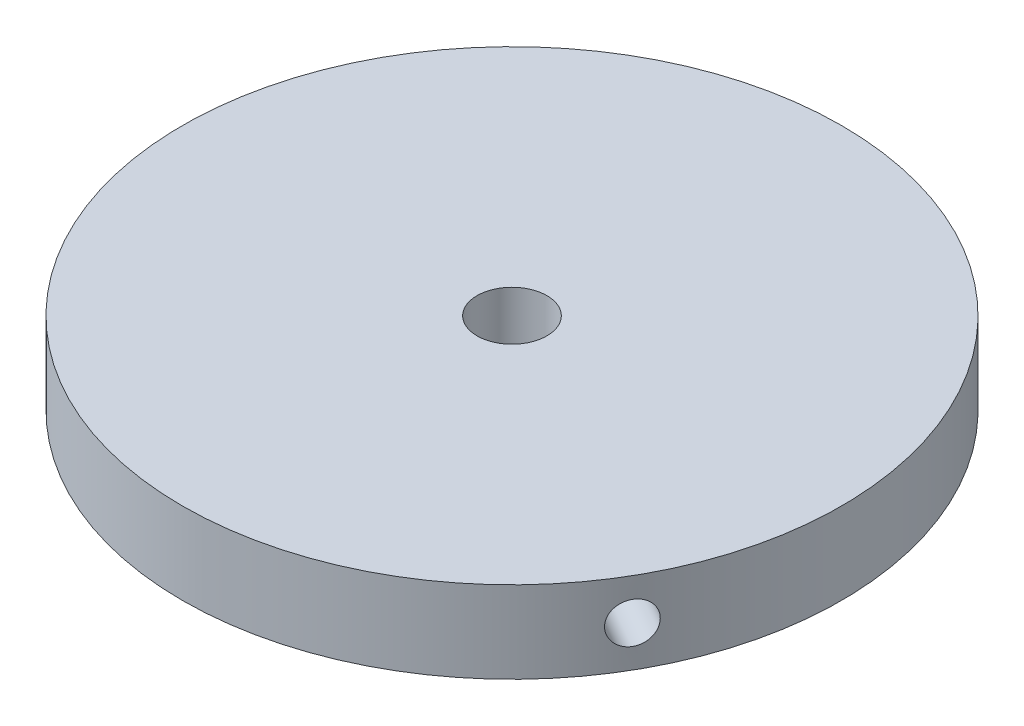
ISO-10303-21;
HEADER;
FILE_DESCRIPTION(('STEP AP214'),'2;1');
FILE_NAME('part.step','',(''),(''),'','','');
FILE_SCHEMA(('AUTOMOTIVE_DESIGN { 1 0 10303 214 1 1 1 1 }'));
ENDSEC;
DATA;
#1=APPLICATION_CONTEXT('core data for automotive mechanical design processes');
#2=APPLICATION_PROTOCOL_DEFINITION('international standard','automotive_design',2000,#1);
#3=PRODUCT_CONTEXT('',#1,'mechanical');
#4=PRODUCT('Part','Part','',(#3));
#5=PRODUCT_RELATED_PRODUCT_CATEGORY('part','',(#4));
#6=PRODUCT_DEFINITION_FORMATION('','',#4);
#7=PRODUCT_DEFINITION_CONTEXT('part definition',#1,'design');
#8=PRODUCT_DEFINITION('design','',#6,#7);
#9=PRODUCT_DEFINITION_SHAPE('','',#8);
#10=(LENGTH_UNIT() NAMED_UNIT(*) SI_UNIT(.MILLI.,.METRE.));
#11=(NAMED_UNIT(*) PLANE_ANGLE_UNIT() SI_UNIT($,.RADIAN.));
#12=(NAMED_UNIT(*) SI_UNIT($,.STERADIAN.) SOLID_ANGLE_UNIT());
#13=UNCERTAINTY_MEASURE_WITH_UNIT(LENGTH_MEASURE(1.E-05),#10,'distance_accuracy_value','');
#14=(GEOMETRIC_REPRESENTATION_CONTEXT(3) GLOBAL_UNCERTAINTY_ASSIGNED_CONTEXT((#13)) GLOBAL_UNIT_ASSIGNED_CONTEXT((#10,
#11,#12)) REPRESENTATION_CONTEXT('',''));
#15=CARTESIAN_POINT('',(0.,0.,0.));
#16=DIRECTION('',(0.,0.,1.));
#17=DIRECTION('',(1.,0.,0.));
#18=AXIS2_PLACEMENT_3D('',#15,#16,#17);
#19=CARTESIAN_POINT('',(0.,9.525,0.));
#20=DIRECTION('',(0.,-1.,0.));
#21=DIRECTION('',(0.,0.,-1.));
#22=AXIS2_PLACEMENT_3D('',#19,#20,#21);
#23=CYLINDRICAL_SURFACE('',#22,38.354);
#24=CARTESIAN_POINT('',(-2.37489999999947,4.7625,-38.2804018525146));
#25=CARTESIAN_POINT('',(-2.37489413527644,4.62923809089192,-38.280402837307));
#26=CARTESIAN_POINT('',(-2.36364579205728,4.49588281019358,-38.2811052035353));
#27=CARTESIAN_POINT('',(-2.31893528967372,4.23285434302784,-38.2838391152481));
#28=CARTESIAN_POINT('',(-2.28544725825848,4.10318562870893,-38.2858722087771));
#29=CARTESIAN_POINT('',(-2.19722280005429,3.85137838047477,-38.2910364070698));
#30=CARTESIAN_POINT('',(-2.14249756959359,3.72923591794559,-38.2941669331792));
#31=CARTESIAN_POINT('',(-2.0133702265039,3.49590258604333,-38.3011725260395));
#32=CARTESIAN_POINT('',(-1.93897262662695,3.38470921301708,-38.3050474219797));
#33=CARTESIAN_POINT('',(-1.77249177631182,3.17623409838296,-38.313111626275));
#34=CARTESIAN_POINT('',(-1.68038560702465,3.07897067303235,-38.3173013377438));
#35=CARTESIAN_POINT('',(-1.4811493827142,2.90127312255656,-38.3255193340163));
#36=CARTESIAN_POINT('',(-1.37401870204228,2.82083969861176,-38.3295476120886));
#37=CARTESIAN_POINT('',(-1.14767193856091,2.67902969934687,-38.3369922882502));
#38=CARTESIAN_POINT('',(-1.02844640814934,2.617668176002,-38.3404082021527));
#39=CARTESIAN_POINT('',(-0.781360599532736,2.51584020554425,-38.3462390227638));
#40=CARTESIAN_POINT('',(-0.653500412377955,2.47537353813936,-38.3486539400257));
#41=CARTESIAN_POINT('',(-0.392950312927091,2.41653451916251,-38.3522078864979));
#42=CARTESIAN_POINT('',(-0.260266868395017,2.39813362823547,-38.3533485636492));
#43=CARTESIAN_POINT('',(0.00631003831154012,2.38386036623799,-38.3542310483331));
#44=CARTESIAN_POINT('',(0.140203487041637,2.38798774516191,-38.3539728713895));
#45=CARTESIAN_POINT('',(0.405206350489969,2.4186303095414,-38.3520881155161));
#46=CARTESIAN_POINT('',(0.536319330484603,2.44511479320974,-38.3504634131721));
#47=CARTESIAN_POINT('',(0.79223504475657,2.51967212930872,-38.3460306871079));
#48=CARTESIAN_POINT('',(0.917037742277915,2.56774510747139,-38.3432226564961));
#49=CARTESIAN_POINT('',(1.15688876407876,2.6841495937017,-38.3367362172293));
#50=CARTESIAN_POINT('',(1.27193031723789,2.75249501899231,-38.3330572109929));
#51=CARTESIAN_POINT('',(1.4889194906947,2.90749419472858,-38.32524287678));
#52=CARTESIAN_POINT('',(1.59086696643578,2.99414814726964,-38.3211075437668));
#53=CARTESIAN_POINT('',(1.77895325879323,3.18347799568063,-38.3128377790858));
#54=CARTESIAN_POINT('',(1.86506525449627,3.28618053913264,-38.3087033605807));
#55=CARTESIAN_POINT('',(2.01882939779048,3.50459884614974,-38.3009084798889));
#56=CARTESIAN_POINT('',(2.0864815381791,3.62031461479223,-38.2972480178872));
#57=CARTESIAN_POINT('',(2.20140364078542,3.8614916273744,-38.2908143984836));
#58=CARTESIAN_POINT('',(2.24867247949577,3.98695340805489,-38.2880412899939));
#59=CARTESIAN_POINT('',(2.32146770175679,4.24405325203897,-38.2836968563364));
#60=CARTESIAN_POINT('',(2.34699433633765,4.37569124401501,-38.2821255172932));
#61=CARTESIAN_POINT('',(2.37554713938468,4.64117285013254,-38.2803644239049));
#62=CARTESIAN_POINT('',(2.3786105873768,4.77501244030646,-38.2801723805149));
#63=CARTESIAN_POINT('',(2.36224745372705,5.04130366654735,-38.2811855558711));
#64=CARTESIAN_POINT('',(2.34282098691788,5.17375530969764,-38.2823907674829));
#65=CARTESIAN_POINT('',(2.28206043506427,5.43340543759909,-38.2860605414526));
#66=CARTESIAN_POINT('',(2.24074351377086,5.56060795394907,-38.2885241171049));
#67=CARTESIAN_POINT('',(2.13739227430593,5.80627343777458,-38.2944321528365));
#68=CARTESIAN_POINT('',(2.07535777171955,5.92473632744399,-38.297876621647));
#69=CARTESIAN_POINT('',(1.9322370171523,6.14973108341426,-38.3053638317819));
#70=CARTESIAN_POINT('',(1.85112578277799,6.25624703183816,-38.3094073550205));
#71=CARTESIAN_POINT('',(1.67219038274815,6.45416396797893,-38.3176342635312));
#72=CARTESIAN_POINT('',(1.57436605635773,6.54556481031257,-38.3218176501481));
#73=CARTESIAN_POINT('',(1.36462091887408,6.71078288610321,-38.3298595625683));
#74=CARTESIAN_POINT('',(1.25268108722025,6.7845759977581,-38.3337176380872));
#75=CARTESIAN_POINT('',(1.01797818211975,6.91231883823295,-38.3406677229239));
#76=CARTESIAN_POINT('',(0.895215174435373,6.96626868761152,-38.343759736896));
#77=CARTESIAN_POINT('',(0.642439443840704,7.05275159763808,-38.3488271428147));
#78=CARTESIAN_POINT('',(0.512431963669555,7.08529993345883,-38.350803331031));
#79=CARTESIAN_POINT('',(0.248784802508945,7.12810588034381,-38.3534195842414));
#80=CARTESIAN_POINT('',(0.115145156485495,7.13836370591669,-38.3540596620933));
#81=CARTESIAN_POINT('',(-0.151733997415274,7.13629537087301,-38.3539316119804));
#82=CARTESIAN_POINT('',(-0.284973800673779,7.12400696553796,-38.3531658382137));
#83=CARTESIAN_POINT('',(-0.547494398021122,7.07727325897385,-38.3503168773641));
#84=CARTESIAN_POINT('',(-0.676775185120192,7.04282791862838,-38.3482336879553));
#85=CARTESIAN_POINT('',(-0.927713747359632,6.9527665950289,-38.3429840573992));
#86=CARTESIAN_POINT('',(-1.04937156996449,6.89715074360862,-38.3398176229976));
#87=CARTESIAN_POINT('',(-1.28162755978365,6.76633244436232,-38.3327570505148));
#88=CARTESIAN_POINT('',(-1.39222601645427,6.69113050934784,-38.3288629314869));
#89=CARTESIAN_POINT('',(-1.59941512264165,6.52313545836678,-38.3207772984907));
#90=CARTESIAN_POINT('',(-1.69598366496083,6.43031510026139,-38.316585330344));
#91=CARTESIAN_POINT('',(-1.87220132348107,6.22975362752857,-38.3083800523644));
#92=CARTESIAN_POINT('',(-1.95184629201931,6.1220088658622,-38.3043667865182));
#93=CARTESIAN_POINT('',(-2.09201385416864,5.89453587654806,-38.2969677917123));
#94=CARTESIAN_POINT('',(-2.15251287202954,5.77479311183602,-38.2935828385411));
#95=CARTESIAN_POINT('',(-2.25247359450025,5.52691573865806,-38.2878336952392));
#96=CARTESIAN_POINT('',(-2.29195994955222,5.39879116220686,-38.285468309652));
#97=CARTESIAN_POINT('',(-2.33850674891413,5.18531841211593,-38.2826463054199));
#98=CARTESIAN_POINT('',(-2.35213658153623,5.10135027860589,-38.2818083941843));
#99=CARTESIAN_POINT('',(-2.37033507097683,4.9324340875067,-38.2806858540897));
#100=CARTESIAN_POINT('',(-2.3749037401495,4.84748603125375,-38.2804012244762));
#101=CARTESIAN_POINT('',(-2.37489999999947,4.7625,-38.2804018525146));
#102=B_SPLINE_CURVE_WITH_KNOTS('',3,(#24,#25,#26,#27,#28,#29,#30,#31,#32,#33,#34,#35,#36,#37,
#38,#39,#40,#41,#42,#43,#44,#45,#46,#47,#48,#49,#50,#51,#52,#53,#54,#55,#56,#57,#58,#59,#60,#61,
#62,#63,#64,#65,#66,#67,#68,#69,#70,#71,#72,#73,#74,#75,#76,#77,#78,#79,#80,#81,#82,#83,#84,#85,
#86,#87,#88,#89,#90,#91,#92,#93,#94,#95,#96,#97,#98,#99,#100,#101),.UNSPECIFIED.,.T.,.F.,(4,2,2,
2,2,2,2,2,2,2,2,2,2,2,2,2,2,2,2,2,2,2,2,2,2,2,2,2,2,2,2,2,2,2,2,2,2,2,4),(0.,0.399475476302926,
0.799416493165484,1.1991469454962,1.59878578090996,1.99894536307211,2.39912161357536,
2.7996128949367,3.20009995387938,3.60006847169276,4.00003255089726,4.39944827316248,
4.79886632166716,5.19855921151562,5.59825651353268,5.99862467916022,6.3989930010006,
6.79938338792527,7.19976915197735,7.59949029185472,7.99920939077927,8.39861554288699,
8.79802525035158,9.19796095582233,9.59790050781335,9.99838485314968,10.3988667652857,
10.7990625252291,11.1992544339451,11.5987768041428,11.9982998796691,12.3978204673125,
12.7973305955817,13.1974635662305,13.5976944894359,13.9984163444992,14.3986670613082,
14.6534276439034,14.908187879153),.UNSPECIFIED.);
#103=CARTESIAN_POINT('',(-2.37489999999947,4.7625,-38.2804018525146));
#104=VERTEX_POINT('',#103);
#105=EDGE_CURVE('E63',#104,#104,#102,.T.);
#106=ORIENTED_EDGE('',*,*,#105,.T.);
#107=EDGE_LOOP('',(#106));
#108=FACE_BOUND('',#107,.T.);
#109=CARTESIAN_POINT('',(34.3392504713542,4.7625,17.0834771948103));
#110=CARTESIAN_POINT('',(34.3392483918479,4.62923809089192,17.0834827662056));
#111=CARTESIAN_POINT('',(34.3342324872348,4.49588281019358,17.093575300298));
#112=CARTESIAN_POINT('',(34.314244873038,4.23285434302784,17.1336626870345));
#113=CARTESIAN_POINT('',(34.2992615679748,4.10318562870893,17.1636807197274));
#114=CARTESIAN_POINT('',(34.2596216657844,3.85137838047477,17.2426674409137));
#115=CARTESIAN_POINT('',(34.2349701656919,3.72923591794559,17.2916261437753));
#116=CARTESIAN_POINT('',(34.1764735155327,3.49590258604333,17.4069564996443));
#117=CARTESIAN_POINT('',(34.1426304739154,3.38470921301708,17.4733241590884));
#118=CARTESIAN_POINT('',(34.0663738545389,3.17623409838296,17.6215329068526));
#119=CARTESIAN_POINT('',(34.0239491664619,3.07897067303234,17.703394045035));
#120=CARTESIAN_POINT('',(33.9314480478468,2.90127312255655,17.8800466747782));
#121=CARTESIAN_POINT('',(33.8813712986549,2.82083969861176,17.9748387048009));
#122=CARTESIAN_POINT('',(33.7746451955932,2.67902969934687,18.174583090121));
#123=CARTESIAN_POINT('',(33.7179906986041,2.617668176002,18.2795433851883));
#124=CARTESIAN_POINT('',(33.5994974330699,2.51584020554425,18.4964413826705));
#125=CARTESIAN_POINT('',(33.5376587191893,2.47537353813936,18.6083790115101));
#126=CARTESIAN_POINT('',(33.4104614773925,2.41653451916251,18.8357989898292));
#127=CARTESIAN_POINT('',(33.345107610517,2.39813362823547,18.9512765620312));
#128=CARTESIAN_POINT('',(33.2125834113185,2.38386036623799,19.1825801776434));
#129=CARTESIAN_POINT('',(33.1454130991616,2.38798774516191,19.2984062171721));
#130=CARTESIAN_POINT('',(33.0112794209712,2.4186303095414,19.5269630510573));
#131=CARTESIAN_POINT('',(32.9443158974703,2.44511479320974,19.6396978713265));
#132=CARTESIAN_POINT('',(32.8125191869547,2.51967212930872,19.8591110180816));
#133=CARTESIAN_POINT('',(32.7476860123496,2.56774510747139,19.96578930929));
#134=CARTESIAN_POINT('',(32.6221430802641,2.6841495937017,20.1702631676598));
#135=CARTESIAN_POINT('',(32.5614361908231,2.75249501899231,20.2680525720682));
#136=CARTESIAN_POINT('',(32.4461741921527,2.90749419472859,20.4520635415216));
#137=CARTESIAN_POINT('',(32.3916191508395,2.99414814726964,20.5382849788584));
#138=CARTESIAN_POINT('',(32.2904141783638,3.18347799568063,20.6970376038031));
#139=CARTESIAN_POINT('',(32.243777669057,3.28618053913264,20.7695455704));
#140=CARTESIAN_POINT('',(32.1601450327113,3.50459884614974,20.898811784338));
#141=CARTESIAN_POINT('',(32.1231489094339,3.62031461479223,20.9555700255341));
#142=CARTESIAN_POINT('',(32.0601161802889,3.8614916273744,21.0518786761456));
#143=CARTESIAN_POINT('',(32.0340801785343,3.98695340805489,21.0914281370314));
#144=CARTESIAN_POINT('',(31.9939201774913,4.24405325203897,21.1522984319548));
#145=CARTESIAN_POINT('',(31.9797960406715,4.37569124401501,21.1736194764533));
#146=CARTESIAN_POINT('',(31.9639944875353,4.64117285013254,21.1974663825472));
#147=CARTESIAN_POINT('',(31.9622964490848,4.77501244030646,21.2000233846365));
#148=CARTESIAN_POINT('',(31.9713554515066,5.04130366654735,21.1863590828884));
#149=CARTESIAN_POINT('',(31.982112428784,5.17375530969764,21.1701378749318));
#150=CARTESIAN_POINT('',(32.0156708221947,5.43340543759909,21.1193525804635));
#151=CARTESIAN_POINT('',(32.0384628019405,5.56060795394906,21.0848028648434));
#152=CARTESIAN_POINT('',(32.0952549307029,5.80627343777458,20.9982520838199));
#153=CARTESIAN_POINT('',(32.1292551794886,5.92473632744399,20.9462508630742));
#154=CARTESIAN_POINT('',(32.2072996709525,6.14973108341426,20.8260482588777));
#155=CARTESIAN_POINT('',(32.2513570819851,6.25624703183816,20.7578256309965));
#156=CARTESIAN_POINT('',(32.3479494937649,6.45416396797893,20.6069764831897));
#157=CARTESIAN_POINT('',(32.4004845760442,6.54556481031257,20.5243498247359));
#158=CARTESIAN_POINT('',(32.5123216452369,6.71078288610321,20.3467261635649));
#159=CARTESIAN_POINT('',(32.5716327524729,6.7845759977581,20.2517124634168));
#160=CARTESIAN_POINT('',(32.6950031550502,6.91231883823295,20.0519288276761));
#161=CARTESIAN_POINT('',(32.7590624215411,6.96626868761152,19.9471589513625));
#162=CARTESIAN_POINT('',(32.8898387890953,7.05275159763808,19.7307824501667));
#163=CARTESIAN_POINT('',(32.9565539583788,7.08529993345883,19.6191807637646));
#164=CARTESIAN_POINT('',(33.0906432807021,7.12810588034381,19.3921637511691));
#165=CARTESIAN_POINT('',(33.1580174273939,7.13836370591669,19.276748461686));
#166=CARTESIAN_POINT('',(33.2913461096936,7.13629537087301,19.045560309611));
#167=CARTESIAN_POINT('',(33.3573028317874,7.12400696553796,18.9297883683105));
#168=CARTESIAN_POINT('',(33.4860958579909,7.07727325897385,18.7010143815662));
#169=CARTESIAN_POINT('',(33.5489321565915,7.04282791862838,18.5880123410128));
#170=CARTESIAN_POINT('',(33.6698551242892,6.9527665950289,18.3680683560463));
#171=CARTESIAN_POINT('',(33.7279418229604,6.89715074360862,18.2611263739006));
#172=CARTESIAN_POINT('',(33.8379551827346,6.76633244436232,18.0564565002946));
#173=CARTESIAN_POINT('',(33.8898820050663,6.69113050934784,17.9587283676846));
#174=CARTESIAN_POINT('',(33.9864741945797,6.52313545836678,17.7752545218408));
#175=CARTESIAN_POINT('',(34.0311281148324,6.43031510026139,17.6895277269126));
#176=CARTESIAN_POINT('',(34.112130964917,6.22975362752858,17.5328161190489));
#177=CARTESIAN_POINT('',(34.1484778590112,6.1220088658622,17.4618349200881));
#178=CARTESIAN_POINT('',(34.2121539226215,5.89453587654806,17.3367467530773));
#179=CARTESIAN_POINT('',(34.2394719761151,5.77479311183602,17.2826605901201));
#180=CARTESIAN_POINT('',(34.284473433201,5.52691573865806,17.1932174934289));
#181=CARTESIAN_POINT('',(34.3021681267188,5.39879116220686,17.1578386140575));
#182=CARTESIAN_POINT('',(34.3229975990451,5.18531841211593,17.1161169012291));
#183=CARTESIAN_POINT('',(34.32908686294,5.10135027860589,17.1038941643113));
#184=CARTESIAN_POINT('',(34.3372139594216,4.9324340875067,17.0875725400979));
#185=CARTESIAN_POINT('',(34.339251797532,4.84748603125375,17.0834736417261));
#186=CARTESIAN_POINT('',(34.3392504713542,4.7625,17.0834771948103));
#187=B_SPLINE_CURVE_WITH_KNOTS('',3,(#109,#110,#111,#112,#113,#114,#115,#116,#117,#118,#119,
#120,#121,#122,#123,#124,#125,#126,#127,#128,#129,#130,#131,#132,#133,#134,#135,#136,#137,#138,
#139,#140,#141,#142,#143,#144,#145,#146,#147,#148,#149,#150,#151,#152,#153,#154,#155,#156,#157,
#158,#159,#160,#161,#162,#163,#164,#165,#166,#167,#168,#169,#170,#171,#172,#173,#174,#175,#176,
#177,#178,#179,#180,#181,#182,#183,#184,#185,#186),.UNSPECIFIED.,.T.,.F.,(4,2,2,2,2,2,2,2,2,2,2,
2,2,2,2,2,2,2,2,2,2,2,2,2,2,2,2,2,2,2,2,2,2,2,2,2,2,2,4),(0.,0.399475476302927,
0.799416493165485,1.1991469454962,1.59878578090996,1.99894536307211,2.39912161357536,
2.7996128949367,3.20009995387938,3.60006847169276,4.00003255089726,4.39944827316248,
4.79886632166716,5.19855921151562,5.59825651353268,5.99862467916022,6.39899300100059,
6.79938338792527,7.19976915197735,7.59949029185472,7.99920939077927,8.39861554288699,
8.79802525035157,9.19796095582232,9.59790050781334,9.99838485314968,10.3988667652857,
10.7990625252291,11.1992544339451,11.5987768041428,11.9982998796691,12.3978204673125,
12.7973305955817,13.1974635662305,13.5976944894359,13.9984163444991,14.3986670613082,
14.6534276439034,14.908187879153),.UNSPECIFIED.);
#188=CARTESIAN_POINT('',(34.3392504713542,4.7625,17.0834771948103));
#189=VERTEX_POINT('',#188);
#190=EDGE_CURVE('E64',#189,#189,#187,.T.);
#191=ORIENTED_EDGE('',*,*,#190,.T.);
#192=EDGE_LOOP('',(#191));
#193=FACE_BOUND('',#192,.T.);
#194=CARTESIAN_POINT('',(-31.9643504713547,4.7625,21.1969246577046));
#195=CARTESIAN_POINT('',(-31.9643542565714,4.62923809089192,21.1969200711017));
#196=CARTESIAN_POINT('',(-31.9705866951775,4.49588281019358,21.1875299032376));
#197=CARTESIAN_POINT('',(-31.9953095833643,4.23285434302784,21.1501764282139));
#198=CARTESIAN_POINT('',(-32.0138143097163,4.10318562870893,21.12219148905));
#199=CARTESIAN_POINT('',(-32.06239886573,3.85137838047477,21.0483689661565));
#200=CARTESIAN_POINT('',(-32.0924725960983,3.72923591794559,21.0025407894042));
#201=CARTESIAN_POINT('',(-32.1631032890288,3.49590258604333,20.8942160263955));
#202=CARTESIAN_POINT('',(-32.2036578472885,3.38470921301707,20.8317232628916));
#203=CARTESIAN_POINT('',(-32.2938820782271,3.17623409838296,20.6915787194227));
#204=CARTESIAN_POINT('',(-32.3435635594372,3.07897067303235,20.6139072927092));
#205=CARTESIAN_POINT('',(-32.4502986651326,2.90127312255656,20.4454726592385));
#206=CARTESIAN_POINT('',(-32.5073525966126,2.82083969861176,20.354708907288));
#207=CARTESIAN_POINT('',(-32.6269732570323,2.67902969934687,20.1624091981295));
#208=CARTESIAN_POINT('',(-32.6895442904547,2.617668176002,20.0608648169647));
#209=CARTESIAN_POINT('',(-32.8181368335371,2.51584020554425,19.8497976400936));
#210=CARTESIAN_POINT('',(-32.8841583068114,2.47537353813936,19.7402749285159));
#211=CARTESIAN_POINT('',(-33.0175111644654,2.41653451916251,19.516408896669));
#212=CARTESIAN_POINT('',(-33.084840742122,2.39813362823547,19.4020720016182));
#213=CARTESIAN_POINT('',(-33.21889344963,2.38386036623799,19.1716508706901));
#214=CARTESIAN_POINT('',(-33.2856165862032,2.38798774516191,19.0555666542177));
#215=CARTESIAN_POINT('',(-33.4164857714611,2.4186303095414,18.8251250644591));
#216=CARTESIAN_POINT('',(-33.4806352279549,2.44511479320974,18.7107655418459));
#217=CARTESIAN_POINT('',(-33.6047542317113,2.51967212930872,18.4869196690266));
#218=CARTESIAN_POINT('',(-33.6647237546276,2.56774510747139,18.3774333472064));
#219=CARTESIAN_POINT('',(-33.7790318443428,2.6841495937017,18.1664730495698));
#220=CARTESIAN_POINT('',(-33.833366508061,2.75249501899231,18.065004638925));
#221=CARTESIAN_POINT('',(-33.9350936828474,2.90749419472858,17.8731793352588));
#222=CARTESIAN_POINT('',(-33.9824861172753,2.99414814726964,17.7828225649087));
#223=CARTESIAN_POINT('',(-34.069367437157,3.18347799568063,17.615800175283));
#224=CARTESIAN_POINT('',(-34.1088429235533,3.28618053913264,17.5391577901811));
#225=CARTESIAN_POINT('',(-34.1789744305018,3.50459884614974,17.4020966955512));
#226=CARTESIAN_POINT('',(-34.209630447613,3.62031461479223,17.3416779923534));
#227=CARTESIAN_POINT('',(-34.2615198210744,3.8614916273744,17.2389357223382));
#228=CARTESIAN_POINT('',(-34.2827526580301,3.98695340805489,17.1966131529628));
#229=CARTESIAN_POINT('',(-34.3153878792481,4.24405325203897,17.1313984243819));
#230=CARTESIAN_POINT('',(-34.3267903770091,4.37569124401501,17.1085060408402));
#231=CARTESIAN_POINT('',(-34.33954162692,4.64117285013254,17.082898041358));
#232=CARTESIAN_POINT('',(-34.3409070364617,4.77501244030646,17.0801489958787));
#233=CARTESIAN_POINT('',(-34.3336029052337,5.04130366654735,17.094826472983));
#234=CARTESIAN_POINT('',(-34.3249334157019,5.17375530969764,17.1122528925514));
#235=CARTESIAN_POINT('',(-34.297731257259,5.43340543759909,17.1667079609895));
#236=CARTESIAN_POINT('',(-34.2792063157113,5.56060795394906,17.2037212522618));
#237=CARTESIAN_POINT('',(-34.2326472050089,5.80627343777458,17.2961800690169));
#238=CARTESIAN_POINT('',(-34.2046129512081,5.92473632744399,17.3516257585731));
#239=CARTESIAN_POINT('',(-34.1395366881048,6.14973108341426,17.4793155729046));
#240=CARTESIAN_POINT('',(-34.1024828647631,6.25624703183816,17.5515817240243));
#241=CARTESIAN_POINT('',(-34.0201398765131,6.45416396797893,17.7106577803419));
#242=CARTESIAN_POINT('',(-33.9748506324019,6.54556481031257,17.7974678254125));
#243=CARTESIAN_POINT('',(-33.876942564111,6.71078288610321,17.9831333990037));
#244=CARTESIAN_POINT('',(-33.8243138396931,6.7845759977581,18.0820051746707));
#245=CARTESIAN_POINT('',(-33.71298133717,6.91231883823295,18.2887388952481));
#246=CARTESIAN_POINT('',(-33.6542775959765,6.96626868761152,18.3966007855338));
#247=CARTESIAN_POINT('',(-33.532278232936,7.05275159763808,18.6180446926483));
#248=CARTESIAN_POINT('',(-33.4689859220484,7.08529993345883,18.7316225672667));
#249=CARTESIAN_POINT('',(-33.339428083211,7.12810588034381,18.9612558330726));
#250=CARTESIAN_POINT('',(-33.2731625838794,7.13836370591669,19.0773112004076));
#251=CARTESIAN_POINT('',(-33.1396121122783,7.13629537087301,19.3083713023697));
#252=CARTESIAN_POINT('',(-33.0723290311136,7.12400696553796,19.4233774699035));
#253=CARTESIAN_POINT('',(-32.9386014599698,7.07727325897385,19.6493024957982));
#254=CARTESIAN_POINT('',(-32.8721569714713,7.04282791862838,19.7602213469428));
#255=CARTESIAN_POINT('',(-32.7421413769296,6.9527665950289,19.9749157013533));
#256=CARTESIAN_POINT('',(-32.6785702529959,6.89715074360862,20.0786912490974));
#257=CARTESIAN_POINT('',(-32.5563276229509,6.76633244436232,20.2763005502204));
#258=CARTESIAN_POINT('',(-32.4976559886121,6.69113050934785,20.3701345638026));
#259=CARTESIAN_POINT('',(-32.387059071938,6.52313545836678,20.5455227766502));
#260=CARTESIAN_POINT('',(-32.3351444498715,6.43031510026139,20.6270576034317));
#261=CARTESIAN_POINT('',(-32.239929641436,6.22975362752858,20.7755639333158));
#262=CARTESIAN_POINT('',(-32.1966315669919,6.1220088658622,20.8425318664304));
#263=CARTESIAN_POINT('',(-32.1201400684528,5.89453587654806,20.9602210386353));
#264=CARTESIAN_POINT('',(-32.0869591040855,5.77479311183602,21.0109222484213));
#265=CARTESIAN_POINT('',(-32.0319998387007,5.52691573865806,21.0946162018106));
#266=CARTESIAN_POINT('',(-32.0102081771665,5.39879116220686,21.1276296955949));
#267=CARTESIAN_POINT('',(-31.9844908501309,5.18531841211594,21.1665294041911));
#268=CARTESIAN_POINT('',(-31.9769502814038,5.10135027860589,21.1779142298734));
#269=CARTESIAN_POINT('',(-31.9668788884447,4.9324340875067,21.1931133139921));
#270=CARTESIAN_POINT('',(-31.9643480573825,4.84748603125375,21.1969275827504));
#271=CARTESIAN_POINT('',(-31.9643504713547,4.7625,21.1969246577046));
#272=B_SPLINE_CURVE_WITH_KNOTS('',3,(#194,#195,#196,#197,#198,#199,#200,#201,#202,#203,#204,
#205,#206,#207,#208,#209,#210,#211,#212,#213,#214,#215,#216,#217,#218,#219,#220,#221,#222,#223,
#224,#225,#226,#227,#228,#229,#230,#231,#232,#233,#234,#235,#236,#237,#238,#239,#240,#241,#242,
#243,#244,#245,#246,#247,#248,#249,#250,#251,#252,#253,#254,#255,#256,#257,#258,#259,#260,#261,
#262,#263,#264,#265,#266,#267,#268,#269,#270,#271),.UNSPECIFIED.,.T.,.F.,(4,2,2,2,2,2,2,2,2,2,2,
2,2,2,2,2,2,2,2,2,2,2,2,2,2,2,2,2,2,2,2,2,2,2,2,2,2,2,4),(0.,0.399475476302926,
0.799416493165484,1.1991469454962,1.59878578090996,1.99894536307211,2.39912161357536,
2.7996128949367,3.20009995387938,3.60006847169276,4.00003255089726,4.39944827316248,
4.79886632166716,5.19855921151562,5.59825651353268,5.99862467916022,6.3989930010006,
6.79938338792527,7.19976915197735,7.59949029185472,7.99920939077927,8.39861554288699,
8.79802525035157,9.19796095582233,9.59790050781334,9.99838485314968,10.3988667652857,
10.7990625252291,11.1992544339451,11.5987768041428,11.9982998796691,12.3978204673125,
12.7973305955817,13.1974635662305,13.5976944894359,13.9984163444991,14.3986670613082,
14.6534276439034,14.908187879153),.UNSPECIFIED.);
#273=CARTESIAN_POINT('',(-31.9643504713547,4.7625,21.1969246577046));
#274=VERTEX_POINT('',#273);
#275=EDGE_CURVE('E10',#274,#274,#272,.T.);
#276=ORIENTED_EDGE('',*,*,#275,.T.);
#277=EDGE_LOOP('',(#276));
#278=FACE_BOUND('',#277,.T.);
#279=CARTESIAN_POINT('',(0.,9.525,0.));
#280=DIRECTION('',(0.,1.,0.));
#281=DIRECTION('',(0.,0.,1.));
#282=AXIS2_PLACEMENT_3D('',#279,#280,#281);
#283=CIRCLE('',#282,38.354);
#284=CARTESIAN_POINT('',(0.,9.525,38.354));
#285=VERTEX_POINT('',#284);
#286=EDGE_CURVE('E46',#285,#285,#283,.T.);
#287=ORIENTED_EDGE('',*,*,#286,.F.);
#288=EDGE_LOOP('',(#287));
#289=FACE_BOUND('',#288,.T.);
#290=CARTESIAN_POINT('',(0.,0.,0.));
#291=DIRECTION('',(0.,1.,0.));
#292=DIRECTION('',(0.,0.,1.));
#293=AXIS2_PLACEMENT_3D('',#290,#291,#292);
#294=CIRCLE('',#293,38.354);
#295=CARTESIAN_POINT('',(0.,0.,38.354));
#296=VERTEX_POINT('',#295);
#297=EDGE_CURVE('E50',#296,#296,#294,.T.);
#298=ORIENTED_EDGE('',*,*,#297,.T.);
#299=EDGE_LOOP('',(#298));
#300=FACE_BOUND('',#299,.T.);
#301=ADVANCED_FACE('F35',(#108,#193,#278,#289,#300),#23,.T.);
#302=CARTESIAN_POINT('',(0.,9.525,0.));
#303=DIRECTION('',(0.,1.,0.));
#304=DIRECTION('',(0.,0.,1.));
#305=AXIS2_PLACEMENT_3D('',#302,#303,#304);
#306=PLANE('',#305);
#307=CARTESIAN_POINT('',(0.,9.525,0.));
#308=DIRECTION('',(0.,1.,0.));
#309=DIRECTION('',(0.,0.,1.));
#310=AXIS2_PLACEMENT_3D('',#307,#308,#309);
#311=CIRCLE('',#310,4.064);
#312=CARTESIAN_POINT('',(0.,9.525,4.064));
#313=VERTEX_POINT('',#312);
#314=EDGE_CURVE('E96',#313,#313,#311,.T.);
#315=ORIENTED_EDGE('',*,*,#314,.F.);
#316=EDGE_LOOP('',(#315));
#317=FACE_BOUND('',#316,.T.);
#318=ORIENTED_EDGE('',*,*,#286,.T.);
#319=EDGE_LOOP('',(#318));
#320=FACE_BOUND('',#319,.T.);
#321=ADVANCED_FACE('F112',(#317,#320),#306,.T.);
#322=CARTESIAN_POINT('',(0.,0.,0.));
#323=DIRECTION('',(0.,1.,0.));
#324=DIRECTION('',(0.,0.,1.));
#325=AXIS2_PLACEMENT_3D('',#322,#323,#324);
#326=PLANE('',#325);
#327=CARTESIAN_POINT('',(0.,0.,0.));
#328=DIRECTION('',(0.,1.,0.));
#329=DIRECTION('',(0.,0.,1.));
#330=AXIS2_PLACEMENT_3D('',#327,#328,#329);
#331=CIRCLE('',#330,4.064);
#332=CARTESIAN_POINT('',(0.,0.,4.064));
#333=VERTEX_POINT('',#332);
#334=EDGE_CURVE('E72',#333,#333,#331,.T.);
#335=ORIENTED_EDGE('',*,*,#334,.T.);
#336=EDGE_LOOP('',(#335));
#337=FACE_BOUND('',#336,.T.);
#338=ORIENTED_EDGE('',*,*,#297,.F.);
#339=EDGE_LOOP('',(#338));
#340=FACE_BOUND('',#339,.T.);
#341=ADVANCED_FACE('F102',(#337,#340),#326,.F.);
#342=CARTESIAN_POINT('',(-27.7162770227173,4.7625,16.0019999999997));
#343=DIRECTION('',(-0.866025403784443,0.,0.499999999999992));
#344=DIRECTION('',(0.499999999999992,0.,0.866025403784443));
#345=AXIS2_PLACEMENT_3D('',#342,#343,#344);
#346=CYLINDRICAL_SURFACE('',#345,2.3749);
#347=CARTESIAN_POINT('',(-27.7162770227173,4.7625,16.0019999999997));
#348=DIRECTION('',(-0.866025403784443,0.,0.499999999999992));
#349=DIRECTION('',(0.499999999999992,0.,0.866025403784443));
#350=AXIS2_PLACEMENT_3D('',#347,#348,#349);
#351=CIRCLE('',#350,2.3749);
#352=CARTESIAN_POINT('',(-26.5288270227173,4.7625,18.0587237314474));
#353=VERTEX_POINT('',#352);
#354=EDGE_CURVE('E55',#353,#353,#351,.T.);
#355=ORIENTED_EDGE('',*,*,#354,.F.);
#356=EDGE_LOOP('',(#355));
#357=FACE_BOUND('',#356,.T.);
#358=ORIENTED_EDGE('',*,*,#275,.F.);
#359=EDGE_LOOP('',(#358));
#360=FACE_BOUND('',#359,.T.);
#361=ADVANCED_FACE('F119',(#357,#360),#346,.F.);
#362=CARTESIAN_POINT('',(-27.7162770227173,4.7625,16.0019999999997));
#363=DIRECTION('',(-0.866025403784443,0.,0.499999999999992));
#364=DIRECTION('',(0.499999999999992,0.,0.866025403784443));
#365=AXIS2_PLACEMENT_3D('',#362,#363,#364);
#366=PLANE('',#365);
#367=ORIENTED_EDGE('',*,*,#354,.T.);
#368=EDGE_LOOP('',(#367));
#369=FACE_BOUND('',#368,.T.);
#370=ADVANCED_FACE('F81',(#369),#366,.T.);
#371=CARTESIAN_POINT('',(27.7162770227169,4.7625,16.0020000000005));
#372=DIRECTION('',(0.866025403784429,0.,0.500000000000016));
#373=DIRECTION('',(0.500000000000016,0.,-0.866025403784429));
#374=AXIS2_PLACEMENT_3D('',#371,#372,#373);
#375=CYLINDRICAL_SURFACE('',#374,2.3749);
#376=CARTESIAN_POINT('',(27.7162770227169,4.7625,16.0020000000005));
#377=DIRECTION('',(0.866025403784429,0.,0.500000000000016));
#378=DIRECTION('',(0.500000000000016,0.,-0.866025403784429));
#379=AXIS2_PLACEMENT_3D('',#376,#377,#378);
#380=CIRCLE('',#379,2.3749);
#381=CARTESIAN_POINT('',(28.9037270227169,4.7625,13.9452762685529));
#382=VERTEX_POINT('',#381);
#383=EDGE_CURVE('E60',#382,#382,#380,.T.);
#384=ORIENTED_EDGE('',*,*,#383,.F.);
#385=EDGE_LOOP('',(#384));
#386=FACE_BOUND('',#385,.T.);
#387=ORIENTED_EDGE('',*,*,#190,.F.);
#388=EDGE_LOOP('',(#387));
#389=FACE_BOUND('',#388,.T.);
#390=ADVANCED_FACE('F76',(#386,#389),#375,.F.);
#391=CARTESIAN_POINT('',(27.7162770227169,4.7625,16.0020000000005));
#392=DIRECTION('',(0.866025403784429,0.,0.500000000000016));
#393=DIRECTION('',(0.500000000000016,0.,-0.866025403784429));
#394=AXIS2_PLACEMENT_3D('',#391,#392,#393);
#395=PLANE('',#394);
#396=ORIENTED_EDGE('',*,*,#383,.T.);
#397=EDGE_LOOP('',(#396));
#398=FACE_BOUND('',#397,.T.);
#399=ADVANCED_FACE('F80',(#398),#395,.T.);
#400=CARTESIAN_POINT('',(4.44089209850063E-13,4.7625,-32.004));
#401=DIRECTION('',(0.,0.,-1.));
#402=DIRECTION('',(-1.,0.,0.));
#403=AXIS2_PLACEMENT_3D('',#400,#401,#402);
#404=CYLINDRICAL_SURFACE('',#403,2.3749);
#405=CARTESIAN_POINT('',(4.44089209850063E-13,4.7625,-32.004));
#406=DIRECTION('',(0.,0.,-1.));
#407=DIRECTION('',(-1.,0.,0.));
#408=AXIS2_PLACEMENT_3D('',#405,#406,#407);
#409=CIRCLE('',#408,2.3749);
#410=CARTESIAN_POINT('',(-2.37489999999956,4.7625,-32.004));
#411=VERTEX_POINT('',#410);
#412=EDGE_CURVE('E59',#411,#411,#409,.T.);
#413=ORIENTED_EDGE('',*,*,#412,.F.);
#414=EDGE_LOOP('',(#413));
#415=FACE_BOUND('',#414,.T.);
#416=ORIENTED_EDGE('',*,*,#105,.F.);
#417=EDGE_LOOP('',(#416));
#418=FACE_BOUND('',#417,.T.);
#419=ADVANCED_FACE('F85',(#415,#418),#404,.F.);
#420=CARTESIAN_POINT('',(4.44089209850063E-13,4.7625,-32.004));
#421=DIRECTION('',(0.,0.,-1.));
#422=DIRECTION('',(-1.,0.,0.));
#423=AXIS2_PLACEMENT_3D('',#420,#421,#422);
#424=PLANE('',#423);
#425=ORIENTED_EDGE('',*,*,#412,.T.);
#426=EDGE_LOOP('',(#425));
#427=FACE_BOUND('',#426,.T.);
#428=ADVANCED_FACE('F108',(#427),#424,.T.);
#429=CARTESIAN_POINT('',(0.,0.,0.));
#430=DIRECTION('',(0.,1.,0.));
#431=DIRECTION('',(0.,0.,1.));
#432=AXIS2_PLACEMENT_3D('',#429,#430,#431);
#433=CYLINDRICAL_SURFACE('',#432,4.064);
#434=ORIENTED_EDGE('',*,*,#334,.F.);
#435=EDGE_LOOP('',(#434));
#436=FACE_BOUND('',#435,.T.);
#437=ORIENTED_EDGE('',*,*,#314,.T.);
#438=EDGE_LOOP('',(#437));
#439=FACE_BOUND('',#438,.T.);
#440=ADVANCED_FACE('F105',(#436,#439),#433,.F.);
#441=CLOSED_SHELL('',(#301,#321,#341,#361,#370,#390,#399,#419,#428,#440));
#442=MANIFOLD_SOLID_BREP('B2',#441);
#443=ADVANCED_BREP_SHAPE_REPRESENTATION('',(#18,#442),#14);
#444=SHAPE_DEFINITION_REPRESENTATION(#9,#443);
ENDSEC;
END-ISO-10303-21;
